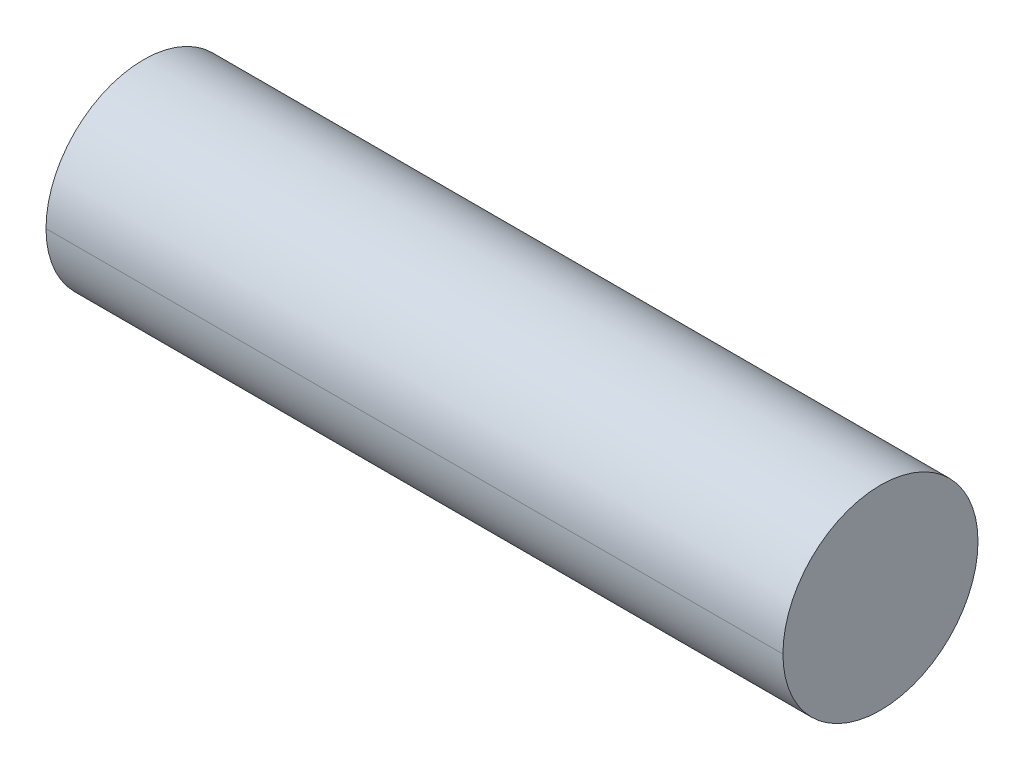
ISO-10303-21;
HEADER;
FILE_DESCRIPTION(('STEP AP214'),'2;1');
FILE_NAME('part.step','',(''),(''),'','','');
FILE_SCHEMA(('AUTOMOTIVE_DESIGN { 1 0 10303 214 1 1 1 1 }'));
ENDSEC;
DATA;
#1=APPLICATION_CONTEXT('core data for automotive mechanical design processes');
#2=APPLICATION_PROTOCOL_DEFINITION('international standard','automotive_design',2000,#1);
#3=PRODUCT_CONTEXT('',#1,'mechanical');
#4=PRODUCT('Part','Part','',(#3));
#5=PRODUCT_RELATED_PRODUCT_CATEGORY('part','',(#4));
#6=PRODUCT_DEFINITION_FORMATION('','',#4);
#7=PRODUCT_DEFINITION_CONTEXT('part definition',#1,'design');
#8=PRODUCT_DEFINITION('design','',#6,#7);
#9=PRODUCT_DEFINITION_SHAPE('','',#8);
#10=(LENGTH_UNIT() NAMED_UNIT(*) SI_UNIT(.MILLI.,.METRE.));
#11=(NAMED_UNIT(*) PLANE_ANGLE_UNIT() SI_UNIT($,.RADIAN.));
#12=(NAMED_UNIT(*) SI_UNIT($,.STERADIAN.) SOLID_ANGLE_UNIT());
#13=UNCERTAINTY_MEASURE_WITH_UNIT(LENGTH_MEASURE(1.E-05),#10,'distance_accuracy_value','');
#14=(GEOMETRIC_REPRESENTATION_CONTEXT(3) GLOBAL_UNCERTAINTY_ASSIGNED_CONTEXT((#13)) GLOBAL_UNIT_ASSIGNED_CONTEXT((#10,
#11,#12)) REPRESENTATION_CONTEXT('',''));
#15=CARTESIAN_POINT('',(0.,0.,0.));
#16=DIRECTION('',(0.,0.,1.));
#17=DIRECTION('',(1.,0.,0.));
#18=AXIS2_PLACEMENT_3D('',#15,#16,#17);
#19=CARTESIAN_POINT('',(0.,0.,0.));
#20=DIRECTION('',(1.,0.,0.));
#21=DIRECTION('',(0.,1.,0.));
#22=AXIS2_PLACEMENT_3D('',#19,#20,#21);
#23=PLANE('',#22);
#24=CARTESIAN_POINT('',(0.,0.,0.));
#25=DIRECTION('',(1.,0.,0.));
#26=DIRECTION('',(0.,0.,-1.));
#27=AXIS2_PLACEMENT_3D('',#24,#25,#26);
#28=CIRCLE('',#27,2.25);
#29=CARTESIAN_POINT('',(0.,0.,2.25));
#30=VERTEX_POINT('',#29);
#31=CARTESIAN_POINT('',(0.,0.,-2.25));
#32=VERTEX_POINT('',#31);
#33=EDGE_CURVE('E9',#30,#32,#28,.T.);
#34=ORIENTED_EDGE('',*,*,#33,.F.);
#35=CARTESIAN_POINT('',(0.,0.,0.));
#36=DIRECTION('',(1.,0.,0.));
#37=DIRECTION('',(0.,0.,-1.));
#38=AXIS2_PLACEMENT_3D('',#35,#36,#37);
#39=CIRCLE('',#38,2.25);
#40=EDGE_CURVE('E64',#32,#30,#39,.T.);
#41=ORIENTED_EDGE('',*,*,#40,.F.);
#42=EDGE_LOOP('',(#34,#41));
#43=FACE_BOUND('',#42,.T.);
#44=ADVANCED_FACE('F14',(#43),#23,.F.);
#45=CARTESIAN_POINT('',(17.,0.,0.));
#46=DIRECTION('',(1.,0.,0.));
#47=DIRECTION('',(0.,1.,0.));
#48=AXIS2_PLACEMENT_3D('',#45,#46,#47);
#49=PLANE('',#48);
#50=CARTESIAN_POINT('',(17.,0.,0.));
#51=DIRECTION('',(1.,0.,0.));
#52=DIRECTION('',(0.,0.,-1.));
#53=AXIS2_PLACEMENT_3D('',#50,#51,#52);
#54=CIRCLE('',#53,2.25);
#55=CARTESIAN_POINT('',(17.,0.,2.25));
#56=VERTEX_POINT('',#55);
#57=CARTESIAN_POINT('',(17.,0.,-2.25));
#58=VERTEX_POINT('',#57);
#59=EDGE_CURVE('E25',#56,#58,#54,.T.);
#60=ORIENTED_EDGE('',*,*,#59,.T.);
#61=CARTESIAN_POINT('',(17.,0.,0.));
#62=DIRECTION('',(1.,0.,0.));
#63=DIRECTION('',(0.,0.,-1.));
#64=AXIS2_PLACEMENT_3D('',#61,#62,#63);
#65=CIRCLE('',#64,2.25);
#66=EDGE_CURVE('E18',#58,#56,#65,.T.);
#67=ORIENTED_EDGE('',*,*,#66,.T.);
#68=EDGE_LOOP('',(#60,#67));
#69=FACE_BOUND('',#68,.T.);
#70=ADVANCED_FACE('F16',(#69),#49,.T.);
#71=CARTESIAN_POINT('',(17.,0.,0.));
#72=DIRECTION('',(-1.,0.,0.));
#73=DIRECTION('',(0.,0.,1.));
#74=AXIS2_PLACEMENT_3D('',#71,#72,#73);
#75=CYLINDRICAL_SURFACE('',#74,2.25);
#76=DIRECTION('',(-1.,0.,0.));
#77=VECTOR('',#76,1.);
#78=CARTESIAN_POINT('',(17.,0.,-2.25));
#79=LINE('',#78,#77);
#80=EDGE_CURVE('E59',#58,#32,#79,.T.);
#81=ORIENTED_EDGE('',*,*,#80,.F.);
#82=ORIENTED_EDGE('',*,*,#59,.F.);
#83=DIRECTION('',(-1.,0.,0.));
#84=VECTOR('',#83,1.);
#85=CARTESIAN_POINT('',(17.,0.,2.25));
#86=LINE('',#85,#84);
#87=EDGE_CURVE('E56',#56,#30,#86,.T.);
#88=ORIENTED_EDGE('',*,*,#87,.T.);
#89=ORIENTED_EDGE('',*,*,#33,.T.);
#90=EDGE_LOOP('',(#81,#82,#88,#89));
#91=FACE_BOUND('',#90,.T.);
#92=ADVANCED_FACE('F60',(#91),#75,.T.);
#93=CARTESIAN_POINT('',(17.,0.,0.));
#94=DIRECTION('',(-1.,0.,0.));
#95=DIRECTION('',(0.,0.,1.));
#96=AXIS2_PLACEMENT_3D('',#93,#94,#95);
#97=CYLINDRICAL_SURFACE('',#96,2.25);
#98=ORIENTED_EDGE('',*,*,#66,.F.);
#99=ORIENTED_EDGE('',*,*,#80,.T.);
#100=ORIENTED_EDGE('',*,*,#40,.T.);
#101=ORIENTED_EDGE('',*,*,#87,.F.);
#102=EDGE_LOOP('',(#98,#99,#100,#101));
#103=FACE_BOUND('',#102,.T.);
#104=ADVANCED_FACE('F66',(#103),#97,.T.);
#105=CLOSED_SHELL('',(#44,#70,#92,#104));
#106=MANIFOLD_SOLID_BREP('B1',#105);
#107=ADVANCED_BREP_SHAPE_REPRESENTATION('',(#18,#106),#14);
#108=SHAPE_DEFINITION_REPRESENTATION(#9,#107);
ENDSEC;
END-ISO-10303-21;
